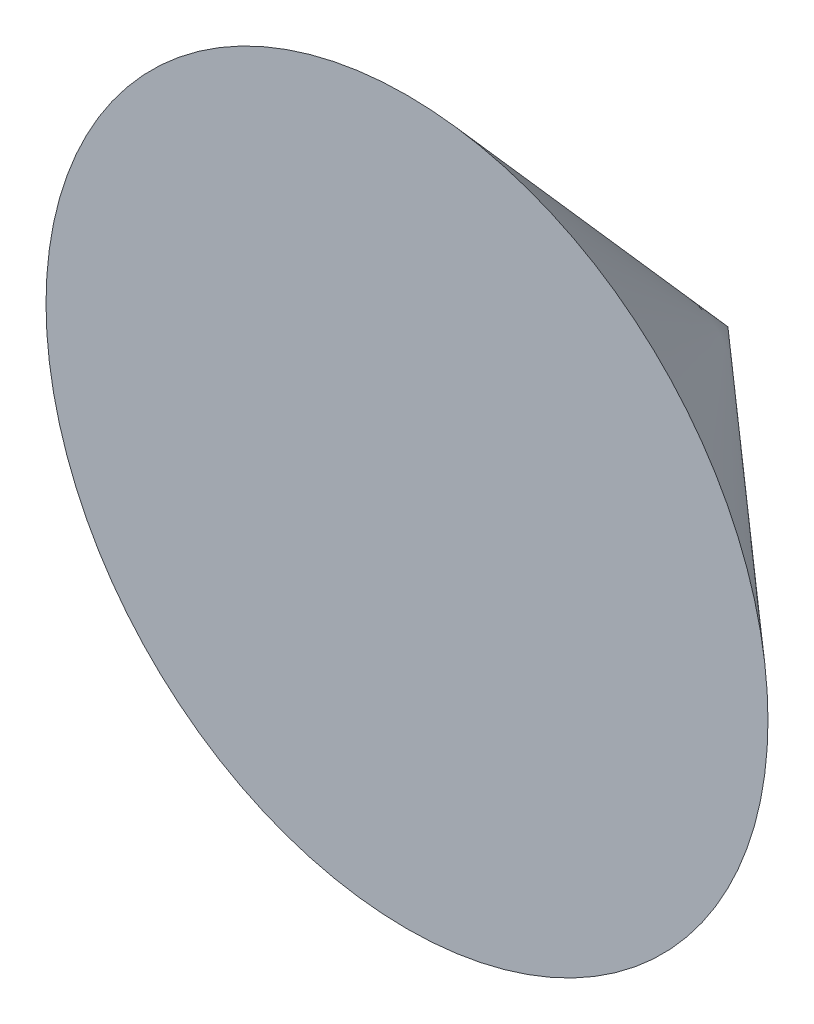
ISO-10303-21;
HEADER;
FILE_DESCRIPTION(('STEP AP214'),'2;1');
FILE_NAME('part.step','',(''),(''),'','','');
FILE_SCHEMA(('AUTOMOTIVE_DESIGN { 1 0 10303 214 1 1 1 1 }'));
ENDSEC;
DATA;
#1=APPLICATION_CONTEXT('core data for automotive mechanical design processes');
#2=APPLICATION_PROTOCOL_DEFINITION('international standard','automotive_design',2000,#1);
#3=PRODUCT_CONTEXT('',#1,'mechanical');
#4=PRODUCT('Part','Part','',(#3));
#5=PRODUCT_RELATED_PRODUCT_CATEGORY('part','',(#4));
#6=PRODUCT_DEFINITION_FORMATION('','',#4);
#7=PRODUCT_DEFINITION_CONTEXT('part definition',#1,'design');
#8=PRODUCT_DEFINITION('design','',#6,#7);
#9=PRODUCT_DEFINITION_SHAPE('','',#8);
#10=(LENGTH_UNIT() NAMED_UNIT(*) SI_UNIT(.MILLI.,.METRE.));
#11=(NAMED_UNIT(*) PLANE_ANGLE_UNIT() SI_UNIT($,.RADIAN.));
#12=(NAMED_UNIT(*) SI_UNIT($,.STERADIAN.) SOLID_ANGLE_UNIT());
#13=UNCERTAINTY_MEASURE_WITH_UNIT(LENGTH_MEASURE(1.E-05),#10,'distance_accuracy_value','');
#14=(GEOMETRIC_REPRESENTATION_CONTEXT(3) GLOBAL_UNCERTAINTY_ASSIGNED_CONTEXT((#13)) GLOBAL_UNIT_ASSIGNED_CONTEXT((#10,
#11,#12)) REPRESENTATION_CONTEXT('',''));
#15=CARTESIAN_POINT('',(0.,0.,0.));
#16=DIRECTION('',(0.,0.,1.));
#17=DIRECTION('',(1.,0.,0.));
#18=AXIS2_PLACEMENT_3D('',#15,#16,#17);
#19=CARTESIAN_POINT('',(0.,9.,0.));
#20=DIRECTION('',(0.,0.,-1.));
#21=DIRECTION('',(-1.,0.,0.));
#22=AXIS2_PLACEMENT_3D('',#19,#20,#21);
#23=PLANE('',#22);
#24=CARTESIAN_POINT('',(0.,0.,0.));
#25=DIRECTION('',(0.,0.,1.));
#26=DIRECTION('',(1.,0.,0.));
#27=AXIS2_PLACEMENT_3D('',#24,#25,#26);
#28=CIRCLE('',#27,9.);
#29=CARTESIAN_POINT('',(9.,0.,0.));
#30=VERTEX_POINT('',#29);
#31=EDGE_CURVE('E11',#30,#30,#28,.T.);
#32=ORIENTED_EDGE('',*,*,#31,.T.);
#33=EDGE_LOOP('',(#32));
#34=FACE_BOUND('',#33,.T.);
#35=ADVANCED_FACE('F45',(#34),#23,.F.);
#36=CARTESIAN_POINT('',(0.,0.,-8.));
#37=DIRECTION('',(0.,0.,1.));
#38=DIRECTION('',(1.,0.,0.));
#39=AXIS2_PLACEMENT_3D('',#36,#37,#38);
#40=CONICAL_SURFACE('',#39,0.,0.844153986113171);
#41=ORIENTED_EDGE('',*,*,#31,.F.);
#42=EDGE_LOOP('',(#41));
#43=FACE_BOUND('',#42,.T.);
#44=CARTESIAN_POINT('',(0.,0.,-8.));
#45=VERTEX_POINT('',#44);
#46=VERTEX_LOOP('',#45);
#47=FACE_BOUND('',#46,.T.);
#48=ADVANCED_FACE('F53',(#43,#47),#40,.T.);
#49=CLOSED_SHELL('',(#35,#48));
#50=MANIFOLD_SOLID_BREP('B2',#49);
#51=ADVANCED_BREP_SHAPE_REPRESENTATION('',(#18,#50),#14);
#52=SHAPE_DEFINITION_REPRESENTATION(#9,#51);
ENDSEC;
END-ISO-10303-21;
